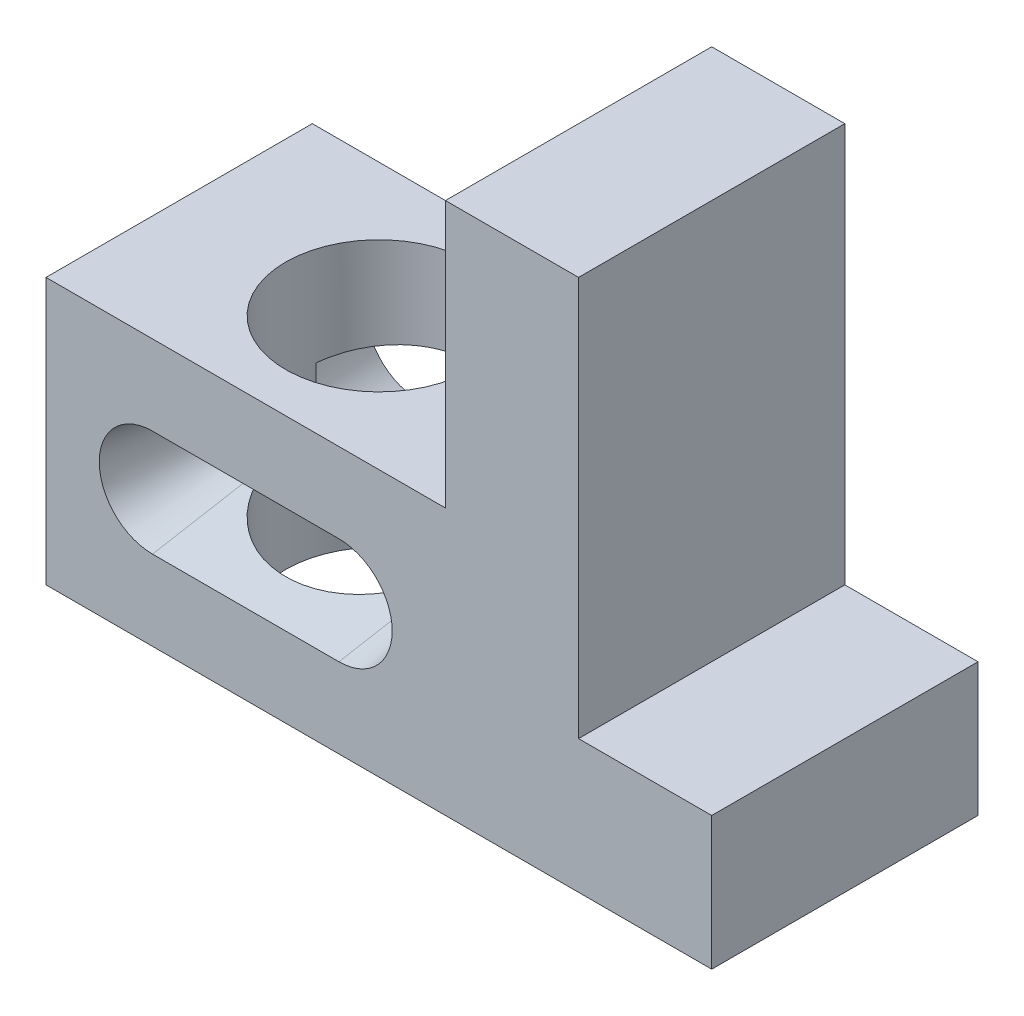
ISO-10303-21;
HEADER;
FILE_DESCRIPTION(('STEP AP214'),'2;1');
FILE_NAME('part.step','',(''),(''),'','','');
FILE_SCHEMA(('AUTOMOTIVE_DESIGN { 1 0 10303 214 1 1 1 1 }'));
ENDSEC;
DATA;
#1=APPLICATION_CONTEXT('core data for automotive mechanical design processes');
#2=APPLICATION_PROTOCOL_DEFINITION('international standard','automotive_design',2000,#1);
#3=PRODUCT_CONTEXT('',#1,'mechanical');
#4=PRODUCT('Part','Part','',(#3));
#5=PRODUCT_RELATED_PRODUCT_CATEGORY('part','',(#4));
#6=PRODUCT_DEFINITION_FORMATION('','',#4);
#7=PRODUCT_DEFINITION_CONTEXT('part definition',#1,'design');
#8=PRODUCT_DEFINITION('design','',#6,#7);
#9=PRODUCT_DEFINITION_SHAPE('','',#8);
#10=(LENGTH_UNIT() NAMED_UNIT(*) SI_UNIT(.MILLI.,.METRE.));
#11=(NAMED_UNIT(*) PLANE_ANGLE_UNIT() SI_UNIT($,.RADIAN.));
#12=(NAMED_UNIT(*) SI_UNIT($,.STERADIAN.) SOLID_ANGLE_UNIT());
#13=UNCERTAINTY_MEASURE_WITH_UNIT(LENGTH_MEASURE(1.E-05),#10,'distance_accuracy_value','');
#14=(GEOMETRIC_REPRESENTATION_CONTEXT(3) GLOBAL_UNCERTAINTY_ASSIGNED_CONTEXT((#13)) GLOBAL_UNIT_ASSIGNED_CONTEXT((#10,
#11,#12)) REPRESENTATION_CONTEXT('',''));
#15=CARTESIAN_POINT('',(0.,0.,0.));
#16=DIRECTION('',(0.,0.,1.));
#17=DIRECTION('',(1.,0.,0.));
#18=AXIS2_PLACEMENT_3D('',#15,#16,#17);
#19=CARTESIAN_POINT('',(-30.7317217964368,25.,30.));
#20=DIRECTION('',(0.,0.,1.));
#21=DIRECTION('',(1.,0.,0.));
#22=AXIS2_PLACEMENT_3D('',#19,#20,#21);
#23=PLANE('',#22);
#24=DIRECTION('',(0.,1.,0.));
#25=VECTOR('',#24,1.);
#26=CARTESIAN_POINT('',(3.53878803481167,-9.99999999999999,30.));
#27=LINE('',#26,#25);
#28=CARTESIAN_POINT('',(3.53878803481167,18.5265396141693,30.));
#29=VERTEX_POINT('',#28);
#30=CARTESIAN_POINT('',(3.53878803481166,31.4734603858307,30.));
#31=VERTEX_POINT('',#30);
#32=EDGE_CURVE('E379',#29,#31,#27,.T.);
#33=ORIENTED_EDGE('',*,*,#32,.F.);
#34=DIRECTION('',(1.,0.,0.));
#35=VECTOR('',#34,1.);
#36=CARTESIAN_POINT('',(-30.7317217964368,18.5265396141693,30.));
#37=LINE('',#36,#35);
#38=CARTESIAN_POINT('',(4.26827820356324,18.5265396141693,30.));
#39=VERTEX_POINT('',#38);
#40=EDGE_CURVE('E219',#29,#39,#37,.T.);
#41=ORIENTED_EDGE('',*,*,#40,.T.);
#42=CARTESIAN_POINT('',(4.26827820356324,25.,30.));
#43=DIRECTION('',(0.,0.,1.));
#44=DIRECTION('',(1.,0.,0.));
#45=AXIS2_PLACEMENT_3D('',#42,#43,#44);
#46=CIRCLE('',#45,6.47346038583071);
#47=CARTESIAN_POINT('',(4.26827820356324,31.4734603858307,30.));
#48=VERTEX_POINT('',#47);
#49=EDGE_CURVE('E223',#39,#48,#46,.T.);
#50=ORIENTED_EDGE('',*,*,#49,.T.);
#51=DIRECTION('',(-1.,0.,0.));
#52=VECTOR('',#51,1.);
#53=CARTESIAN_POINT('',(-30.7317217964368,31.4734603858307,30.));
#54=LINE('',#53,#52);
#55=EDGE_CURVE('E214',#48,#31,#54,.T.);
#56=ORIENTED_EDGE('',*,*,#55,.T.);
#57=EDGE_LOOP('',(#33,#41,#50,#56));
#58=FACE_BOUND('',#57,.T.);
#59=ADVANCED_FACE('F31',(#58),#23,.T.);
#60=CARTESIAN_POINT('',(4.26827820356324,25.,20.));
#61=DIRECTION('',(0.,0.,-1.));
#62=DIRECTION('',(-1.,0.,0.));
#63=AXIS2_PLACEMENT_3D('',#60,#61,#62);
#64=PLANE('',#63);
#65=DIRECTION('',(0.,1.,0.));
#66=VECTOR('',#65,1.);
#67=CARTESIAN_POINT('',(-30.0022316276852,-10.,20.));
#68=LINE('',#67,#66);
#69=CARTESIAN_POINT('',(-30.0022316276852,18.5265396141693,20.));
#70=VERTEX_POINT('',#69);
#71=CARTESIAN_POINT('',(-30.0022316276852,31.4734603858307,20.));
#72=VERTEX_POINT('',#71);
#73=EDGE_CURVE('E11',#70,#72,#68,.T.);
#74=ORIENTED_EDGE('',*,*,#73,.F.);
#75=DIRECTION('',(-1.,0.,0.));
#76=VECTOR('',#75,1.);
#77=CARTESIAN_POINT('',(4.26827820356323,18.5265396141693,20.));
#78=LINE('',#77,#76);
#79=CARTESIAN_POINT('',(-30.7317217964368,18.5265396141693,20.));
#80=VERTEX_POINT('',#79);
#81=EDGE_CURVE('E180',#70,#80,#78,.T.);
#82=ORIENTED_EDGE('',*,*,#81,.T.);
#83=CARTESIAN_POINT('',(-30.7317217964368,25.,20.));
#84=DIRECTION('',(0.,0.,-1.));
#85=DIRECTION('',(-1.,0.,0.));
#86=AXIS2_PLACEMENT_3D('',#83,#84,#85);
#87=CIRCLE('',#86,6.4734603858307);
#88=CARTESIAN_POINT('',(-30.7317217964368,31.4734603858307,20.));
#89=VERTEX_POINT('',#88);
#90=EDGE_CURVE('E186',#80,#89,#87,.T.);
#91=ORIENTED_EDGE('',*,*,#90,.T.);
#92=DIRECTION('',(1.,0.,0.));
#93=VECTOR('',#92,1.);
#94=CARTESIAN_POINT('',(4.26827820356323,31.4734603858307,20.));
#95=LINE('',#94,#93);
#96=EDGE_CURVE('E403',#89,#72,#95,.T.);
#97=ORIENTED_EDGE('',*,*,#96,.T.);
#98=EDGE_LOOP('',(#74,#82,#91,#97));
#99=FACE_BOUND('',#98,.T.);
#100=ADVANCED_FACE('F334',(#99),#64,.T.);
#101=CARTESIAN_POINT('',(-50.7317217964368,50.,50.));
#102=DIRECTION('',(1.,0.,0.));
#103=DIRECTION('',(0.,0.,-1.));
#104=AXIS2_PLACEMENT_3D('',#101,#102,#103);
#105=PLANE('',#104);
#106=DIRECTION('',(0.,-1.,0.));
#107=VECTOR('',#106,1.);
#108=CARTESIAN_POINT('',(-50.7317217964368,50.,0.));
#109=LINE('',#108,#107);
#110=CARTESIAN_POINT('',(-50.7317217964368,50.,0.));
#111=VERTEX_POINT('',#110);
#112=CARTESIAN_POINT('',(-50.7317217964368,0.,0.));
#113=VERTEX_POINT('',#112);
#114=EDGE_CURVE('E208',#111,#113,#109,.T.);
#115=ORIENTED_EDGE('',*,*,#114,.T.);
#116=DIRECTION('',(0.,0.,-1.));
#117=VECTOR('',#116,1.);
#118=CARTESIAN_POINT('',(-50.7317217964368,0.,50.));
#119=LINE('',#118,#117);
#120=CARTESIAN_POINT('',(-50.7317217964368,0.,50.));
#121=VERTEX_POINT('',#120);
#122=EDGE_CURVE('E171',#121,#113,#119,.T.);
#123=ORIENTED_EDGE('',*,*,#122,.F.);
#124=DIRECTION('',(0.,-1.,0.));
#125=VECTOR('',#124,1.);
#126=CARTESIAN_POINT('',(-50.7317217964368,50.,50.));
#127=LINE('',#126,#125);
#128=CARTESIAN_POINT('',(-50.7317217964368,50.,50.));
#129=VERTEX_POINT('',#128);
#130=EDGE_CURVE('E229',#129,#121,#127,.T.);
#131=ORIENTED_EDGE('',*,*,#130,.F.);
#132=DIRECTION('',(0.,0.,-1.));
#133=VECTOR('',#132,1.);
#134=CARTESIAN_POINT('',(-50.7317217964368,50.,50.));
#135=LINE('',#134,#133);
#136=EDGE_CURVE('E247',#129,#111,#135,.T.);
#137=ORIENTED_EDGE('',*,*,#136,.T.);
#138=EDGE_LOOP('',(#115,#123,#131,#137));
#139=FACE_BOUND('',#138,.T.);
#140=ADVANCED_FACE('F33',(#139),#105,.F.);
#141=CARTESIAN_POINT('',(-50.7317217964368,0.,50.));
#142=DIRECTION('',(0.,1.,0.));
#143=DIRECTION('',(0.,0.,1.));
#144=AXIS2_PLACEMENT_3D('',#141,#142,#143);
#145=PLANE('',#144);
#146=CARTESIAN_POINT('',(-13.2317217964368,0.,25.));
#147=DIRECTION('',(0.,1.,0.));
#148=DIRECTION('',(0.,0.,1.));
#149=AXIS2_PLACEMENT_3D('',#146,#147,#148);
#150=CIRCLE('',#149,17.5);
#151=CARTESIAN_POINT('',(-13.2317217964368,0.,42.5));
#152=VERTEX_POINT('',#151);
#153=EDGE_CURVE('E384',#152,#152,#150,.T.);
#154=ORIENTED_EDGE('',*,*,#153,.T.);
#155=EDGE_LOOP('',(#154));
#156=FACE_BOUND('',#155,.T.);
#157=DIRECTION('',(1.,0.,0.));
#158=VECTOR('',#157,1.);
#159=CARTESIAN_POINT('',(-50.7317217964368,0.,0.));
#160=LINE('',#159,#158);
#161=CARTESIAN_POINT('',(74.2682782035632,0.,0.));
#162=VERTEX_POINT('',#161);
#163=EDGE_CURVE('E250',#113,#162,#160,.T.);
#164=ORIENTED_EDGE('',*,*,#163,.T.);
#165=DIRECTION('',(0.,0.,-1.));
#166=VECTOR('',#165,1.);
#167=CARTESIAN_POINT('',(74.2682782035632,0.,50.));
#168=LINE('',#167,#166);
#169=CARTESIAN_POINT('',(74.2682782035632,0.,50.));
#170=VERTEX_POINT('',#169);
#171=EDGE_CURVE('E280',#170,#162,#168,.T.);
#172=ORIENTED_EDGE('',*,*,#171,.F.);
#173=DIRECTION('',(1.,0.,0.));
#174=VECTOR('',#173,1.);
#175=CARTESIAN_POINT('',(-50.7317217964368,0.,50.));
#176=LINE('',#175,#174);
#177=EDGE_CURVE('E232',#121,#170,#176,.T.);
#178=ORIENTED_EDGE('',*,*,#177,.F.);
#179=ORIENTED_EDGE('',*,*,#122,.T.);
#180=EDGE_LOOP('',(#164,#172,#178,#179));
#181=FACE_BOUND('',#180,.T.);
#182=ADVANCED_FACE('F286',(#156,#181),#145,.F.);
#183=CARTESIAN_POINT('',(74.2682782035632,0.,50.));
#184=DIRECTION('',(-1.,0.,0.));
#185=DIRECTION('',(0.,0.,1.));
#186=AXIS2_PLACEMENT_3D('',#183,#184,#185);
#187=PLANE('',#186);
#188=DIRECTION('',(0.,1.,0.));
#189=VECTOR('',#188,1.);
#190=CARTESIAN_POINT('',(74.2682782035632,0.,0.));
#191=LINE('',#190,#189);
#192=CARTESIAN_POINT('',(74.2682782035632,25.,0.));
#193=VERTEX_POINT('',#192);
#194=EDGE_CURVE('E252',#162,#193,#191,.T.);
#195=ORIENTED_EDGE('',*,*,#194,.T.);
#196=DIRECTION('',(0.,0.,-1.));
#197=VECTOR('',#196,1.);
#198=CARTESIAN_POINT('',(74.2682782035632,25.,50.));
#199=LINE('',#198,#197);
#200=CARTESIAN_POINT('',(74.2682782035632,25.,50.));
#201=VERTEX_POINT('',#200);
#202=EDGE_CURVE('E277',#201,#193,#199,.T.);
#203=ORIENTED_EDGE('',*,*,#202,.F.);
#204=DIRECTION('',(0.,1.,0.));
#205=VECTOR('',#204,1.);
#206=CARTESIAN_POINT('',(74.2682782035632,0.,50.));
#207=LINE('',#206,#205);
#208=EDGE_CURVE('E235',#170,#201,#207,.T.);
#209=ORIENTED_EDGE('',*,*,#208,.F.);
#210=ORIENTED_EDGE('',*,*,#171,.T.);
#211=EDGE_LOOP('',(#195,#203,#209,#210));
#212=FACE_BOUND('',#211,.T.);
#213=ADVANCED_FACE('F301',(#212),#187,.F.);
#214=CARTESIAN_POINT('',(74.2682782035632,25.,50.));
#215=DIRECTION('',(0.,-1.,0.));
#216=DIRECTION('',(0.,0.,-1.));
#217=AXIS2_PLACEMENT_3D('',#214,#215,#216);
#218=PLANE('',#217);
#219=DIRECTION('',(-1.,0.,0.));
#220=VECTOR('',#219,1.);
#221=CARTESIAN_POINT('',(74.2682782035632,25.,0.));
#222=LINE('',#221,#220);
#223=CARTESIAN_POINT('',(49.2682782035632,25.,0.));
#224=VERTEX_POINT('',#223);
#225=EDGE_CURVE('E254',#193,#224,#222,.T.);
#226=ORIENTED_EDGE('',*,*,#225,.T.);
#227=DIRECTION('',(0.,0.,-1.));
#228=VECTOR('',#227,1.);
#229=CARTESIAN_POINT('',(49.2682782035632,25.,50.));
#230=LINE('',#229,#228);
#231=CARTESIAN_POINT('',(49.2682782035632,25.,50.));
#232=VERTEX_POINT('',#231);
#233=EDGE_CURVE('E274',#232,#224,#230,.T.);
#234=ORIENTED_EDGE('',*,*,#233,.F.);
#235=DIRECTION('',(-1.,0.,0.));
#236=VECTOR('',#235,1.);
#237=CARTESIAN_POINT('',(74.2682782035632,25.,50.));
#238=LINE('',#237,#236);
#239=EDGE_CURVE('E237',#201,#232,#238,.T.);
#240=ORIENTED_EDGE('',*,*,#239,.F.);
#241=ORIENTED_EDGE('',*,*,#202,.T.);
#242=EDGE_LOOP('',(#226,#234,#240,#241));
#243=FACE_BOUND('',#242,.T.);
#244=ADVANCED_FACE('F305',(#243),#218,.F.);
#245=CARTESIAN_POINT('',(49.2682782035632,25.,50.));
#246=DIRECTION('',(-1.,0.,0.));
#247=DIRECTION('',(0.,-1.,0.));
#248=AXIS2_PLACEMENT_3D('',#245,#246,#247);
#249=PLANE('',#248);
#250=DIRECTION('',(0.,1.,0.));
#251=VECTOR('',#250,1.);
#252=CARTESIAN_POINT('',(49.2682782035632,25.,0.));
#253=LINE('',#252,#251);
#254=CARTESIAN_POINT('',(49.2682782035632,100.,0.));
#255=VERTEX_POINT('',#254);
#256=EDGE_CURVE('E256',#224,#255,#253,.T.);
#257=ORIENTED_EDGE('',*,*,#256,.T.);
#258=DIRECTION('',(0.,0.,-1.));
#259=VECTOR('',#258,1.);
#260=CARTESIAN_POINT('',(49.2682782035632,100.,50.));
#261=LINE('',#260,#259);
#262=CARTESIAN_POINT('',(49.2682782035632,100.,50.));
#263=VERTEX_POINT('',#262);
#264=EDGE_CURVE('E271',#263,#255,#261,.T.);
#265=ORIENTED_EDGE('',*,*,#264,.F.);
#266=DIRECTION('',(0.,1.,0.));
#267=VECTOR('',#266,1.);
#268=CARTESIAN_POINT('',(49.2682782035632,25.,50.));
#269=LINE('',#268,#267);
#270=EDGE_CURVE('E239',#232,#263,#269,.T.);
#271=ORIENTED_EDGE('',*,*,#270,.F.);
#272=ORIENTED_EDGE('',*,*,#233,.T.);
#273=EDGE_LOOP('',(#257,#265,#271,#272));
#274=FACE_BOUND('',#273,.T.);
#275=ADVANCED_FACE('F324',(#274),#249,.F.);
#276=CARTESIAN_POINT('',(49.2682782035632,100.,50.));
#277=DIRECTION('',(0.,-1.,0.));
#278=DIRECTION('',(1.,0.,0.));
#279=AXIS2_PLACEMENT_3D('',#276,#277,#278);
#280=PLANE('',#279);
#281=DIRECTION('',(-1.,0.,0.));
#282=VECTOR('',#281,1.);
#283=CARTESIAN_POINT('',(49.2682782035632,100.,0.));
#284=LINE('',#283,#282);
#285=CARTESIAN_POINT('',(24.2682782035632,100.,0.));
#286=VERTEX_POINT('',#285);
#287=EDGE_CURVE('E258',#255,#286,#284,.T.);
#288=ORIENTED_EDGE('',*,*,#287,.T.);
#289=DIRECTION('',(0.,0.,-1.));
#290=VECTOR('',#289,1.);
#291=CARTESIAN_POINT('',(24.2682782035632,100.,50.));
#292=LINE('',#291,#290);
#293=CARTESIAN_POINT('',(24.2682782035632,100.,50.));
#294=VERTEX_POINT('',#293);
#295=EDGE_CURVE('E268',#294,#286,#292,.T.);
#296=ORIENTED_EDGE('',*,*,#295,.F.);
#297=DIRECTION('',(-1.,0.,0.));
#298=VECTOR('',#297,1.);
#299=CARTESIAN_POINT('',(49.2682782035632,100.,50.));
#300=LINE('',#299,#298);
#301=EDGE_CURVE('E241',#263,#294,#300,.T.);
#302=ORIENTED_EDGE('',*,*,#301,.F.);
#303=ORIENTED_EDGE('',*,*,#264,.T.);
#304=EDGE_LOOP('',(#288,#296,#302,#303));
#305=FACE_BOUND('',#304,.T.);
#306=ADVANCED_FACE('F321',(#305),#280,.F.);
#307=CARTESIAN_POINT('',(24.2682782035632,100.,50.));
#308=DIRECTION('',(1.,0.,0.));
#309=DIRECTION('',(0.,1.,0.));
#310=AXIS2_PLACEMENT_3D('',#307,#308,#309);
#311=PLANE('',#310);
#312=DIRECTION('',(0.,-1.,0.));
#313=VECTOR('',#312,1.);
#314=CARTESIAN_POINT('',(24.2682782035632,100.,0.));
#315=LINE('',#314,#313);
#316=CARTESIAN_POINT('',(24.2682782035632,50.,0.));
#317=VERTEX_POINT('',#316);
#318=EDGE_CURVE('E260',#286,#317,#315,.T.);
#319=ORIENTED_EDGE('',*,*,#318,.T.);
#320=DIRECTION('',(0.,0.,-1.));
#321=VECTOR('',#320,1.);
#322=CARTESIAN_POINT('',(24.2682782035632,50.,50.));
#323=LINE('',#322,#321);
#324=CARTESIAN_POINT('',(24.2682782035632,50.,50.));
#325=VERTEX_POINT('',#324);
#326=EDGE_CURVE('E265',#325,#317,#323,.T.);
#327=ORIENTED_EDGE('',*,*,#326,.F.);
#328=DIRECTION('',(0.,-1.,0.));
#329=VECTOR('',#328,1.);
#330=CARTESIAN_POINT('',(24.2682782035632,100.,50.));
#331=LINE('',#330,#329);
#332=EDGE_CURVE('E243',#294,#325,#331,.T.);
#333=ORIENTED_EDGE('',*,*,#332,.F.);
#334=ORIENTED_EDGE('',*,*,#295,.T.);
#335=EDGE_LOOP('',(#319,#327,#333,#334));
#336=FACE_BOUND('',#335,.T.);
#337=ADVANCED_FACE('F317',(#336),#311,.F.);
#338=CARTESIAN_POINT('',(24.2682782035632,50.,50.));
#339=DIRECTION('',(0.,-1.,0.));
#340=DIRECTION('',(1.,0.,0.));
#341=AXIS2_PLACEMENT_3D('',#338,#339,#340);
#342=PLANE('',#341);
#343=CARTESIAN_POINT('',(-13.2317217964368,50.,25.));
#344=DIRECTION('',(0.,1.,0.));
#345=DIRECTION('',(-1.,0.,0.));
#346=AXIS2_PLACEMENT_3D('',#343,#344,#345);
#347=CIRCLE('',#346,17.5);
#348=CARTESIAN_POINT('',(-30.7317217964368,50.,25.));
#349=VERTEX_POINT('',#348);
#350=EDGE_CURVE('E181',#349,#349,#347,.T.);
#351=ORIENTED_EDGE('',*,*,#350,.F.);
#352=EDGE_LOOP('',(#351));
#353=FACE_BOUND('',#352,.T.);
#354=DIRECTION('',(-1.,0.,0.));
#355=VECTOR('',#354,1.);
#356=CARTESIAN_POINT('',(24.2682782035632,50.,0.));
#357=LINE('',#356,#355);
#358=EDGE_CURVE('E233',#317,#111,#357,.T.);
#359=ORIENTED_EDGE('',*,*,#358,.T.);
#360=ORIENTED_EDGE('',*,*,#136,.F.);
#361=DIRECTION('',(-1.,0.,0.));
#362=VECTOR('',#361,1.);
#363=CARTESIAN_POINT('',(24.2682782035632,50.,50.));
#364=LINE('',#363,#362);
#365=EDGE_CURVE('E245',#325,#129,#364,.T.);
#366=ORIENTED_EDGE('',*,*,#365,.F.);
#367=ORIENTED_EDGE('',*,*,#326,.T.);
#368=EDGE_LOOP('',(#359,#360,#366,#367));
#369=FACE_BOUND('',#368,.T.);
#370=ADVANCED_FACE('F315',(#353,#369),#342,.F.);
#371=CARTESIAN_POINT('',(-50.7317217964368,0.,50.));
#372=DIRECTION('',(0.,0.,1.));
#373=DIRECTION('',(1.,0.,0.));
#374=AXIS2_PLACEMENT_3D('',#371,#372,#373);
#375=PLANE('',#374);
#376=CARTESIAN_POINT('',(-30.7317217964368,25.,50.));
#377=DIRECTION('',(0.,0.,1.));
#378=DIRECTION('',(1.,0.,0.));
#379=AXIS2_PLACEMENT_3D('',#376,#377,#378);
#380=CIRCLE('',#379,10.);
#381=CARTESIAN_POINT('',(-30.7317217964368,35.,50.));
#382=VERTEX_POINT('',#381);
#383=CARTESIAN_POINT('',(-30.7317217964368,15.,50.));
#384=VERTEX_POINT('',#383);
#385=EDGE_CURVE('E193',#382,#384,#380,.T.);
#386=ORIENTED_EDGE('',*,*,#385,.F.);
#387=DIRECTION('',(-1.,0.,0.));
#388=VECTOR('',#387,1.);
#389=CARTESIAN_POINT('',(-30.7317217964368,35.,50.));
#390=LINE('',#389,#388);
#391=CARTESIAN_POINT('',(4.26827820356324,35.,50.));
#392=VERTEX_POINT('',#391);
#393=EDGE_CURVE('E202',#392,#382,#390,.T.);
#394=ORIENTED_EDGE('',*,*,#393,.F.);
#395=CARTESIAN_POINT('',(4.26827820356324,25.,50.));
#396=DIRECTION('',(0.,0.,1.));
#397=DIRECTION('',(1.,0.,0.));
#398=AXIS2_PLACEMENT_3D('',#395,#396,#397);
#399=CIRCLE('',#398,10.);
#400=CARTESIAN_POINT('',(4.26827820356323,15.,50.));
#401=VERTEX_POINT('',#400);
#402=EDGE_CURVE('E199',#401,#392,#399,.T.);
#403=ORIENTED_EDGE('',*,*,#402,.F.);
#404=DIRECTION('',(1.,0.,0.));
#405=VECTOR('',#404,1.);
#406=CARTESIAN_POINT('',(-30.7317217964368,15.,50.));
#407=LINE('',#406,#405);
#408=EDGE_CURVE('E195',#384,#401,#407,.T.);
#409=ORIENTED_EDGE('',*,*,#408,.F.);
#410=EDGE_LOOP('',(#386,#394,#403,#409));
#411=FACE_BOUND('',#410,.T.);
#412=ORIENTED_EDGE('',*,*,#130,.T.);
#413=ORIENTED_EDGE('',*,*,#177,.T.);
#414=ORIENTED_EDGE('',*,*,#208,.T.);
#415=ORIENTED_EDGE('',*,*,#239,.T.);
#416=ORIENTED_EDGE('',*,*,#270,.T.);
#417=ORIENTED_EDGE('',*,*,#301,.T.);
#418=ORIENTED_EDGE('',*,*,#332,.T.);
#419=ORIENTED_EDGE('',*,*,#365,.T.);
#420=EDGE_LOOP('',(#412,#413,#414,#415,#416,#417,#418,#419));
#421=FACE_BOUND('',#420,.T.);
#422=ADVANCED_FACE('F309',(#411,#421),#375,.T.);
#423=CARTESIAN_POINT('',(-50.7317217964368,0.,0.));
#424=DIRECTION('',(0.,0.,1.));
#425=DIRECTION('',(1.,0.,0.));
#426=AXIS2_PLACEMENT_3D('',#423,#424,#425);
#427=PLANE('',#426);
#428=DIRECTION('',(-1.,0.,0.));
#429=VECTOR('',#428,1.);
#430=CARTESIAN_POINT('',(-30.7317217964368,15.,0.));
#431=LINE('',#430,#429);
#432=CARTESIAN_POINT('',(4.26827820356324,15.,0.));
#433=VERTEX_POINT('',#432);
#434=CARTESIAN_POINT('',(-30.7317217964368,15.,0.));
#435=VERTEX_POINT('',#434);
#436=EDGE_CURVE('E389',#433,#435,#431,.T.);
#437=ORIENTED_EDGE('',*,*,#436,.F.);
#438=CARTESIAN_POINT('',(4.26827820356324,25.,0.));
#439=DIRECTION('',(0.,0.,-1.));
#440=DIRECTION('',(-1.,0.,0.));
#441=AXIS2_PLACEMENT_3D('',#438,#439,#440);
#442=CIRCLE('',#441,10.);
#443=CARTESIAN_POINT('',(4.26827820356324,35.,0.));
#444=VERTEX_POINT('',#443);
#445=EDGE_CURVE('E387',#444,#433,#442,.T.);
#446=ORIENTED_EDGE('',*,*,#445,.F.);
#447=DIRECTION('',(1.,0.,0.));
#448=VECTOR('',#447,1.);
#449=CARTESIAN_POINT('',(4.26827820356324,35.,0.));
#450=LINE('',#449,#448);
#451=CARTESIAN_POINT('',(-30.7317217964368,35.,0.));
#452=VERTEX_POINT('',#451);
#453=EDGE_CURVE('E395',#452,#444,#450,.T.);
#454=ORIENTED_EDGE('',*,*,#453,.F.);
#455=CARTESIAN_POINT('',(-30.7317217964368,25.,0.));
#456=DIRECTION('',(0.,0.,-1.));
#457=DIRECTION('',(-1.,0.,0.));
#458=AXIS2_PLACEMENT_3D('',#455,#456,#457);
#459=CIRCLE('',#458,10.);
#460=EDGE_CURVE('E392',#435,#452,#459,.T.);
#461=ORIENTED_EDGE('',*,*,#460,.F.);
#462=EDGE_LOOP('',(#437,#446,#454,#461));
#463=FACE_BOUND('',#462,.T.);
#464=ORIENTED_EDGE('',*,*,#114,.F.);
#465=ORIENTED_EDGE('',*,*,#358,.F.);
#466=ORIENTED_EDGE('',*,*,#318,.F.);
#467=ORIENTED_EDGE('',*,*,#287,.F.);
#468=ORIENTED_EDGE('',*,*,#256,.F.);
#469=ORIENTED_EDGE('',*,*,#225,.F.);
#470=ORIENTED_EDGE('',*,*,#194,.F.);
#471=ORIENTED_EDGE('',*,*,#163,.F.);
#472=EDGE_LOOP('',(#464,#465,#466,#467,#468,#469,#470,#471));
#473=FACE_BOUND('',#472,.T.);
#474=ADVANCED_FACE('F294',(#463,#473),#427,.F.);
#475=CARTESIAN_POINT('',(-30.7317217964368,25.,50.));
#476=DIRECTION('',(0.,0.,1.));
#477=DIRECTION('',(1.,0.,0.));
#478=AXIS2_PLACEMENT_3D('',#475,#476,#477);
#479=CONICAL_SURFACE('',#478,10.,0.174532925199433);
#480=ORIENTED_EDGE('',*,*,#385,.T.);
#481=DIRECTION('',(0.,-0.173648177666931,0.984807753012208));
#482=VECTOR('',#481,1.);
#483=CARTESIAN_POINT('',(-30.7317217964368,15.,50.));
#484=LINE('',#483,#482);
#485=CARTESIAN_POINT('',(-30.7317217964368,18.5265396141693,30.));
#486=VERTEX_POINT('',#485);
#487=EDGE_CURVE('E210',#486,#384,#484,.T.);
#488=ORIENTED_EDGE('',*,*,#487,.F.);
#489=CARTESIAN_POINT('',(-30.7317217964368,25.,30.));
#490=DIRECTION('',(0.,0.,1.));
#491=DIRECTION('',(1.,0.,0.));
#492=AXIS2_PLACEMENT_3D('',#489,#490,#491);
#493=CIRCLE('',#492,6.4734603858307);
#494=CARTESIAN_POINT('',(-30.7317217964368,31.4734603858307,30.));
#495=VERTEX_POINT('',#494);
#496=EDGE_CURVE('E205',#495,#486,#493,.T.);
#497=ORIENTED_EDGE('',*,*,#496,.F.);
#498=DIRECTION('',(0.,0.173648177666931,0.984807753012208));
#499=VECTOR('',#498,1.);
#500=CARTESIAN_POINT('',(-30.7317217964368,35.,50.));
#501=LINE('',#500,#499);
#502=EDGE_CURVE('E206',#495,#382,#501,.T.);
#503=ORIENTED_EDGE('',*,*,#502,.T.);
#504=EDGE_LOOP('',(#480,#488,#497,#503));
#505=FACE_BOUND('',#504,.T.);
#506=ADVANCED_FACE('F374',(#505),#479,.F.);
#507=CARTESIAN_POINT('',(-30.7317217964368,35.,50.));
#508=DIRECTION('',(0.,0.984807753012208,-0.173648177666931));
#509=DIRECTION('',(0.,0.173648177666931,0.984807753012208));
#510=AXIS2_PLACEMENT_3D('',#507,#508,#509);
#511=PLANE('',#510);
#512=CARTESIAN_POINT('',(-30.0022316276852,31.4734603858307,30.));
#513=VERTEX_POINT('',#512);
#514=EDGE_CURVE('E222',#513,#495,#54,.T.);
#515=ORIENTED_EDGE('',*,*,#514,.F.);
#516=CARTESIAN_POINT('',(-13.2317217964368,30.5918254822884,25.));
#517=DIRECTION('',(0.,0.984807753012208,-0.173648177666931));
#518=DIRECTION('',(0.,0.173648177666931,0.984807753012208));
#519=AXIS2_PLACEMENT_3D('',#516,#517,#518);
#520=ELLIPSE('',#519,17.7699657080005,17.5);
#521=EDGE_CURVE('E46',#513,#31,#520,.T.);
#522=ORIENTED_EDGE('',*,*,#521,.T.);
#523=ORIENTED_EDGE('',*,*,#55,.F.);
#524=DIRECTION('',(0.,0.173648177666931,0.984807753012208));
#525=VECTOR('',#524,1.);
#526=CARTESIAN_POINT('',(4.26827820356324,35.,50.));
#527=LINE('',#526,#525);
#528=EDGE_CURVE('E209',#48,#392,#527,.T.);
#529=ORIENTED_EDGE('',*,*,#528,.T.);
#530=ORIENTED_EDGE('',*,*,#393,.T.);
#531=ORIENTED_EDGE('',*,*,#502,.F.);
#532=EDGE_LOOP('',(#515,#522,#523,#529,#530,#531));
#533=FACE_BOUND('',#532,.T.);
#534=ADVANCED_FACE('F368',(#533),#511,.F.);
#535=CARTESIAN_POINT('',(4.26827820356324,25.,50.));
#536=DIRECTION('',(0.,0.,1.));
#537=DIRECTION('',(1.,0.,0.));
#538=AXIS2_PLACEMENT_3D('',#535,#536,#537);
#539=CONICAL_SURFACE('',#538,10.,0.174532925199433);
#540=ORIENTED_EDGE('',*,*,#402,.T.);
#541=ORIENTED_EDGE('',*,*,#528,.F.);
#542=ORIENTED_EDGE('',*,*,#49,.F.);
#543=DIRECTION('',(0.,-0.173648177666931,0.984807753012208));
#544=VECTOR('',#543,1.);
#545=CARTESIAN_POINT('',(4.26827820356324,15.,50.));
#546=LINE('',#545,#544);
#547=EDGE_CURVE('E213',#39,#401,#546,.T.);
#548=ORIENTED_EDGE('',*,*,#547,.T.);
#549=EDGE_LOOP('',(#540,#541,#542,#548));
#550=FACE_BOUND('',#549,.T.);
#551=ADVANCED_FACE('F357',(#550),#539,.F.);
#552=CARTESIAN_POINT('',(-30.7317217964368,15.,50.));
#553=DIRECTION('',(0.,-0.984807753012208,-0.173648177666931));
#554=DIRECTION('',(0.,0.173648177666931,-0.984807753012208));
#555=AXIS2_PLACEMENT_3D('',#552,#553,#554);
#556=PLANE('',#555);
#557=ORIENTED_EDGE('',*,*,#40,.F.);
#558=CARTESIAN_POINT('',(-13.2317217964368,19.4081745177116,25.));
#559=DIRECTION('',(0.,-0.984807753012208,-0.173648177666931));
#560=DIRECTION('',(0.,0.173648177666931,-0.984807753012208));
#561=AXIS2_PLACEMENT_3D('',#558,#559,#560);
#562=ELLIPSE('',#561,17.7699657080005,17.5);
#563=CARTESIAN_POINT('',(-30.0022316276852,18.5265396141693,30.));
#564=VERTEX_POINT('',#563);
#565=EDGE_CURVE('E365',#29,#564,#562,.T.);
#566=ORIENTED_EDGE('',*,*,#565,.T.);
#567=EDGE_CURVE('E226',#486,#564,#37,.T.);
#568=ORIENTED_EDGE('',*,*,#567,.F.);
#569=ORIENTED_EDGE('',*,*,#487,.T.);
#570=ORIENTED_EDGE('',*,*,#408,.T.);
#571=ORIENTED_EDGE('',*,*,#547,.F.);
#572=EDGE_LOOP('',(#557,#566,#568,#569,#570,#571));
#573=FACE_BOUND('',#572,.T.);
#574=ADVANCED_FACE('F348',(#573),#556,.F.);
#575=DIRECTION('',(0.,1.,0.));
#576=VECTOR('',#575,1.);
#577=CARTESIAN_POINT('',(-30.0022316276852,-10.,30.));
#578=LINE('',#577,#576);
#579=EDGE_CURVE('E360',#513,#564,#578,.F.);
#580=ORIENTED_EDGE('',*,*,#579,.F.);
#581=ORIENTED_EDGE('',*,*,#514,.T.);
#582=ORIENTED_EDGE('',*,*,#496,.T.);
#583=ORIENTED_EDGE('',*,*,#567,.T.);
#584=EDGE_LOOP('',(#580,#581,#582,#583));
#585=FACE_BOUND('',#584,.T.);
#586=ADVANCED_FACE('F337',(#585),#23,.T.);
#587=CARTESIAN_POINT('',(4.26827820356324,25.,0.));
#588=DIRECTION('',(0.,0.,-1.));
#589=DIRECTION('',(-1.,0.,0.));
#590=AXIS2_PLACEMENT_3D('',#587,#588,#589);
#591=CONICAL_SURFACE('',#590,10.,0.174532925199433);
#592=ORIENTED_EDGE('',*,*,#445,.T.);
#593=DIRECTION('',(0.,-0.173648177666931,-0.984807753012208));
#594=VECTOR('',#593,1.);
#595=CARTESIAN_POINT('',(4.26827820356324,15.,0.));
#596=LINE('',#595,#594);
#597=CARTESIAN_POINT('',(4.26827820356324,18.5265396141693,20.));
#598=VERTEX_POINT('',#597);
#599=EDGE_CURVE('E400',#598,#433,#596,.T.);
#600=ORIENTED_EDGE('',*,*,#599,.F.);
#601=CARTESIAN_POINT('',(4.26827820356324,25.,20.));
#602=DIRECTION('',(0.,0.,-1.));
#603=DIRECTION('',(-1.,0.,0.));
#604=AXIS2_PLACEMENT_3D('',#601,#602,#603);
#605=CIRCLE('',#604,6.47346038583071);
#606=CARTESIAN_POINT('',(4.26827820356324,31.4734603858307,20.));
#607=VERTEX_POINT('',#606);
#608=EDGE_CURVE('E185',#607,#598,#605,.T.);
#609=ORIENTED_EDGE('',*,*,#608,.F.);
#610=DIRECTION('',(0.,0.173648177666931,-0.984807753012208));
#611=VECTOR('',#610,1.);
#612=CARTESIAN_POINT('',(4.26827820356324,35.,0.));
#613=LINE('',#612,#611);
#614=EDGE_CURVE('E196',#607,#444,#613,.T.);
#615=ORIENTED_EDGE('',*,*,#614,.T.);
#616=EDGE_LOOP('',(#592,#600,#609,#615));
#617=FACE_BOUND('',#616,.T.);
#618=ADVANCED_FACE('F347',(#617),#591,.F.);
#619=CARTESIAN_POINT('',(4.26827820356324,35.,0.));
#620=DIRECTION('',(0.,0.984807753012208,0.173648177666931));
#621=DIRECTION('',(0.,-0.173648177666931,0.984807753012208));
#622=AXIS2_PLACEMENT_3D('',#619,#620,#621);
#623=PLANE('',#622);
#624=CARTESIAN_POINT('',(3.53878803481166,31.4734603858307,20.));
#625=VERTEX_POINT('',#624);
#626=EDGE_CURVE('E189',#625,#607,#95,.T.);
#627=ORIENTED_EDGE('',*,*,#626,.F.);
#628=CARTESIAN_POINT('',(-13.2317217964368,30.5918254822884,25.));
#629=DIRECTION('',(0.,0.984807753012208,0.173648177666931));
#630=DIRECTION('',(0.,0.173648177666931,-0.984807753012208));
#631=AXIS2_PLACEMENT_3D('',#628,#629,#630);
#632=ELLIPSE('',#631,17.7699657080005,17.5);
#633=EDGE_CURVE('E53',#625,#72,#632,.T.);
#634=ORIENTED_EDGE('',*,*,#633,.T.);
#635=ORIENTED_EDGE('',*,*,#96,.F.);
#636=DIRECTION('',(0.,0.173648177666931,-0.984807753012208));
#637=VECTOR('',#636,1.);
#638=CARTESIAN_POINT('',(-30.7317217964368,35.,0.));
#639=LINE('',#638,#637);
#640=EDGE_CURVE('E399',#89,#452,#639,.T.);
#641=ORIENTED_EDGE('',*,*,#640,.T.);
#642=ORIENTED_EDGE('',*,*,#453,.T.);
#643=ORIENTED_EDGE('',*,*,#614,.F.);
#644=EDGE_LOOP('',(#627,#634,#635,#641,#642,#643));
#645=FACE_BOUND('',#644,.T.);
#646=ADVANCED_FACE('F354',(#645),#623,.F.);
#647=CARTESIAN_POINT('',(-30.7317217964368,25.,0.));
#648=DIRECTION('',(0.,0.,-1.));
#649=DIRECTION('',(-1.,0.,0.));
#650=AXIS2_PLACEMENT_3D('',#647,#648,#649);
#651=CONICAL_SURFACE('',#650,10.,0.174532925199433);
#652=ORIENTED_EDGE('',*,*,#460,.T.);
#653=ORIENTED_EDGE('',*,*,#640,.F.);
#654=ORIENTED_EDGE('',*,*,#90,.F.);
#655=DIRECTION('',(0.,-0.173648177666931,-0.984807753012208));
#656=VECTOR('',#655,1.);
#657=CARTESIAN_POINT('',(-30.7317217964368,15.,0.));
#658=LINE('',#657,#656);
#659=EDGE_CURVE('E402',#80,#435,#658,.T.);
#660=ORIENTED_EDGE('',*,*,#659,.T.);
#661=EDGE_LOOP('',(#652,#653,#654,#660));
#662=FACE_BOUND('',#661,.T.);
#663=ADVANCED_FACE('F416',(#662),#651,.F.);
#664=CARTESIAN_POINT('',(-30.7317217964368,15.,0.));
#665=DIRECTION('',(0.,-0.984807753012208,0.173648177666931));
#666=DIRECTION('',(0.,-0.173648177666931,-0.984807753012208));
#667=AXIS2_PLACEMENT_3D('',#664,#665,#666);
#668=PLANE('',#667);
#669=ORIENTED_EDGE('',*,*,#81,.F.);
#670=CARTESIAN_POINT('',(-13.2317217964368,19.4081745177116,25.));
#671=DIRECTION('',(0.,-0.984807753012208,0.173648177666931));
#672=DIRECTION('',(0.,0.173648177666931,0.984807753012208));
#673=AXIS2_PLACEMENT_3D('',#670,#671,#672);
#674=ELLIPSE('',#673,17.7699657080005,17.5);
#675=CARTESIAN_POINT('',(3.53878803481167,18.5265396141693,20.));
#676=VERTEX_POINT('',#675);
#677=EDGE_CURVE('E166',#70,#676,#674,.T.);
#678=ORIENTED_EDGE('',*,*,#677,.T.);
#679=EDGE_CURVE('E177',#598,#676,#78,.T.);
#680=ORIENTED_EDGE('',*,*,#679,.F.);
#681=ORIENTED_EDGE('',*,*,#599,.T.);
#682=ORIENTED_EDGE('',*,*,#436,.T.);
#683=ORIENTED_EDGE('',*,*,#659,.F.);
#684=EDGE_LOOP('',(#669,#678,#680,#681,#682,#683));
#685=FACE_BOUND('',#684,.T.);
#686=ADVANCED_FACE('F175',(#685),#668,.F.);
#687=DIRECTION('',(0.,1.,0.));
#688=VECTOR('',#687,1.);
#689=CARTESIAN_POINT('',(3.53878803481167,-9.99999999999999,20.));
#690=LINE('',#689,#688);
#691=EDGE_CURVE('E39',#625,#676,#690,.F.);
#692=ORIENTED_EDGE('',*,*,#691,.F.);
#693=ORIENTED_EDGE('',*,*,#626,.T.);
#694=ORIENTED_EDGE('',*,*,#608,.T.);
#695=ORIENTED_EDGE('',*,*,#679,.T.);
#696=EDGE_LOOP('',(#692,#693,#694,#695));
#697=FACE_BOUND('',#696,.T.);
#698=ADVANCED_FACE('F183',(#697),#64,.T.);
#699=CARTESIAN_POINT('',(-13.2317217964368,-9.99999999999999,25.));
#700=DIRECTION('',(0.,1.,0.));
#701=DIRECTION('',(-1.,0.,0.));
#702=AXIS2_PLACEMENT_3D('',#699,#700,#701);
#703=CYLINDRICAL_SURFACE('',#702,17.5);
#704=ORIENTED_EDGE('',*,*,#350,.T.);
#705=EDGE_LOOP('',(#704));
#706=FACE_BOUND('',#705,.T.);
#707=ORIENTED_EDGE('',*,*,#73,.T.);
#708=ORIENTED_EDGE('',*,*,#633,.F.);
#709=ORIENTED_EDGE('',*,*,#691,.T.);
#710=ORIENTED_EDGE('',*,*,#677,.F.);
#711=EDGE_LOOP('',(#707,#708,#709,#710));
#712=FACE_BOUND('',#711,.T.);
#713=ORIENTED_EDGE('',*,*,#32,.T.);
#714=ORIENTED_EDGE('',*,*,#521,.F.);
#715=ORIENTED_EDGE('',*,*,#579,.T.);
#716=ORIENTED_EDGE('',*,*,#565,.F.);
#717=EDGE_LOOP('',(#713,#714,#715,#716));
#718=FACE_BOUND('',#717,.T.);
#719=ORIENTED_EDGE('',*,*,#153,.F.);
#720=EDGE_LOOP('',(#719));
#721=FACE_BOUND('',#720,.T.);
#722=ADVANCED_FACE('F165',(#706,#712,#718,#721),#703,.F.);
#723=CLOSED_SHELL('',(#59,#100,#140,#182,#213,#244,#275,#306,#337,#370,#422,#474,#506,#534,#551,
#574,#586,#618,#646,#663,#686,#698,#722));
#724=MANIFOLD_SOLID_BREP('B2',#723);
#725=ADVANCED_BREP_SHAPE_REPRESENTATION('',(#18,#724),#14);
#726=SHAPE_DEFINITION_REPRESENTATION(#9,#725);
ENDSEC;
END-ISO-10303-21;
